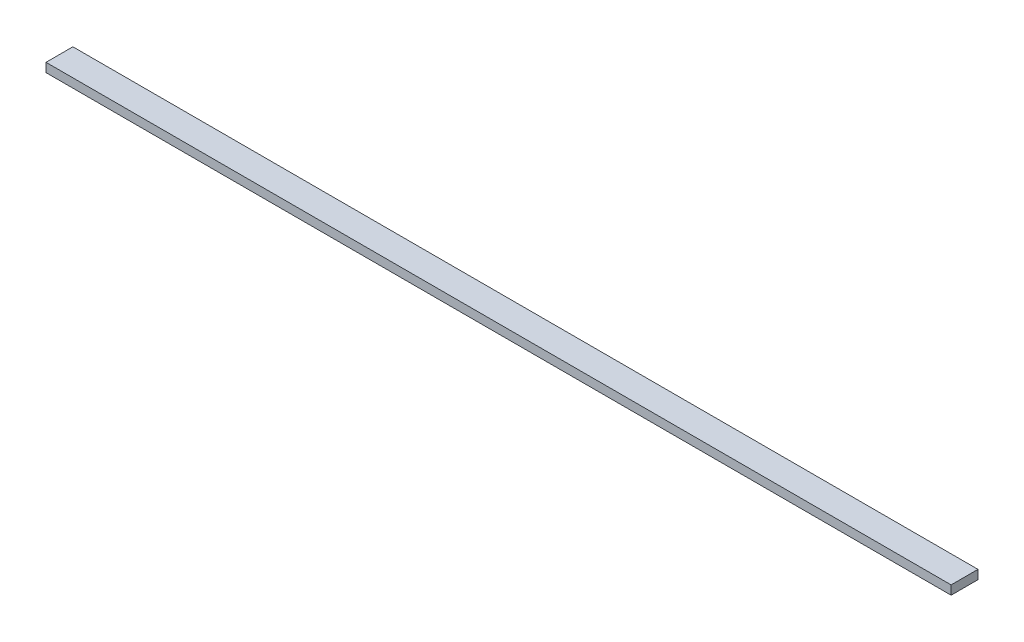
ISO-10303-21;
HEADER;
FILE_DESCRIPTION(('STEP AP214'),'2;1');
FILE_NAME('part.step','',(''),(''),'','','');
FILE_SCHEMA(('AUTOMOTIVE_DESIGN { 1 0 10303 214 1 1 1 1 }'));
ENDSEC;
DATA;
#1=APPLICATION_CONTEXT('core data for automotive mechanical design processes');
#2=APPLICATION_PROTOCOL_DEFINITION('international standard','automotive_design',2000,#1);
#3=PRODUCT_CONTEXT('',#1,'mechanical');
#4=PRODUCT('Part','Part','',(#3));
#5=PRODUCT_RELATED_PRODUCT_CATEGORY('part','',(#4));
#6=PRODUCT_DEFINITION_FORMATION('','',#4);
#7=PRODUCT_DEFINITION_CONTEXT('part definition',#1,'design');
#8=PRODUCT_DEFINITION('design','',#6,#7);
#9=PRODUCT_DEFINITION_SHAPE('','',#8);
#10=(LENGTH_UNIT() NAMED_UNIT(*) SI_UNIT(.MILLI.,.METRE.));
#11=(NAMED_UNIT(*) PLANE_ANGLE_UNIT() SI_UNIT($,.RADIAN.));
#12=(NAMED_UNIT(*) SI_UNIT($,.STERADIAN.) SOLID_ANGLE_UNIT());
#13=UNCERTAINTY_MEASURE_WITH_UNIT(LENGTH_MEASURE(1.E-05),#10,'distance_accuracy_value','');
#14=(GEOMETRIC_REPRESENTATION_CONTEXT(3) GLOBAL_UNCERTAINTY_ASSIGNED_CONTEXT((#13)) GLOBAL_UNIT_ASSIGNED_CONTEXT((#10,
#11,#12)) REPRESENTATION_CONTEXT('',''));
#15=CARTESIAN_POINT('',(0.,0.,0.));
#16=DIRECTION('',(0.,0.,1.));
#17=DIRECTION('',(1.,0.,0.));
#18=AXIS2_PLACEMENT_3D('',#15,#16,#17);
#19=CARTESIAN_POINT('',(-505.,10.,-14.9999999999999));
#20=DIRECTION('',(1.,0.,0.));
#21=DIRECTION('',(0.,0.,-1.));
#22=AXIS2_PLACEMENT_3D('',#19,#20,#21);
#23=PLANE('',#22);
#24=DIRECTION('',(0.,0.,1.));
#25=VECTOR('',#24,1.);
#26=CARTESIAN_POINT('',(-505.,0.,-14.9999999999999));
#27=LINE('',#26,#25);
#28=CARTESIAN_POINT('',(-505.,0.,-14.9999999999999));
#29=VERTEX_POINT('',#28);
#30=CARTESIAN_POINT('',(-505.,0.,15.0000000000001));
#31=VERTEX_POINT('',#30);
#32=EDGE_CURVE('E98',#29,#31,#27,.T.);
#33=ORIENTED_EDGE('',*,*,#32,.T.);
#34=DIRECTION('',(0.,-1.,0.));
#35=VECTOR('',#34,1.);
#36=CARTESIAN_POINT('',(-505.,10.,15.0000000000001));
#37=LINE('',#36,#35);
#38=CARTESIAN_POINT('',(-505.,10.,15.0000000000001));
#39=VERTEX_POINT('',#38);
#40=EDGE_CURVE('E11',#39,#31,#37,.T.);
#41=ORIENTED_EDGE('',*,*,#40,.F.);
#42=DIRECTION('',(0.,0.,1.));
#43=VECTOR('',#42,1.);
#44=CARTESIAN_POINT('',(-505.,10.,-14.9999999999999));
#45=LINE('',#44,#43);
#46=CARTESIAN_POINT('',(-505.,10.,-14.9999999999999));
#47=VERTEX_POINT('',#46);
#48=EDGE_CURVE('E86',#47,#39,#45,.T.);
#49=ORIENTED_EDGE('',*,*,#48,.F.);
#50=DIRECTION('',(0.,-1.,0.));
#51=VECTOR('',#50,1.);
#52=CARTESIAN_POINT('',(-505.,10.,-14.9999999999999));
#53=LINE('',#52,#51);
#54=EDGE_CURVE('E94',#47,#29,#53,.T.);
#55=ORIENTED_EDGE('',*,*,#54,.T.);
#56=EDGE_LOOP('',(#33,#41,#49,#55));
#57=FACE_BOUND('',#56,.T.);
#58=ADVANCED_FACE('F35',(#57),#23,.F.);
#59=CARTESIAN_POINT('',(-505.,10.,15.0000000000001));
#60=DIRECTION('',(0.,0.,-1.));
#61=DIRECTION('',(-1.,0.,0.));
#62=AXIS2_PLACEMENT_3D('',#59,#60,#61);
#63=PLANE('',#62);
#64=DIRECTION('',(1.,0.,0.));
#65=VECTOR('',#64,1.);
#66=CARTESIAN_POINT('',(-505.,0.,15.0000000000001));
#67=LINE('',#66,#65);
#68=CARTESIAN_POINT('',(505.,0.,15.));
#69=VERTEX_POINT('',#68);
#70=EDGE_CURVE('E90',#31,#69,#67,.T.);
#71=ORIENTED_EDGE('',*,*,#70,.T.);
#72=DIRECTION('',(0.,-1.,0.));
#73=VECTOR('',#72,1.);
#74=CARTESIAN_POINT('',(505.,10.,15.));
#75=LINE('',#74,#73);
#76=CARTESIAN_POINT('',(505.,10.,15.));
#77=VERTEX_POINT('',#76);
#78=EDGE_CURVE('E43',#77,#69,#75,.T.);
#79=ORIENTED_EDGE('',*,*,#78,.F.);
#80=DIRECTION('',(1.,0.,0.));
#81=VECTOR('',#80,1.);
#82=CARTESIAN_POINT('',(-505.,10.,15.0000000000001));
#83=LINE('',#82,#81);
#84=EDGE_CURVE('E81',#39,#77,#83,.T.);
#85=ORIENTED_EDGE('',*,*,#84,.F.);
#86=ORIENTED_EDGE('',*,*,#40,.T.);
#87=EDGE_LOOP('',(#71,#79,#85,#86));
#88=FACE_BOUND('',#87,.T.);
#89=ADVANCED_FACE('F89',(#88),#63,.F.);
#90=CARTESIAN_POINT('',(505.,10.,-14.9999999999999));
#91=DIRECTION('',(-1.,0.,0.));
#92=DIRECTION('',(0.,0.,1.));
#93=AXIS2_PLACEMENT_3D('',#90,#91,#92);
#94=PLANE('',#93);
#95=DIRECTION('',(0.,0.,-1.));
#96=VECTOR('',#95,1.);
#97=CARTESIAN_POINT('',(505.,0.,-14.9999999999999));
#98=LINE('',#97,#96);
#99=CARTESIAN_POINT('',(505.,0.,-14.9999999999999));
#100=VERTEX_POINT('',#99);
#101=EDGE_CURVE('E68',#69,#100,#98,.T.);
#102=ORIENTED_EDGE('',*,*,#101,.T.);
#103=DIRECTION('',(0.,-1.,0.));
#104=VECTOR('',#103,1.);
#105=CARTESIAN_POINT('',(505.,10.,-14.9999999999999));
#106=LINE('',#105,#104);
#107=CARTESIAN_POINT('',(505.,10.,-14.9999999999999));
#108=VERTEX_POINT('',#107);
#109=EDGE_CURVE('E91',#108,#100,#106,.T.);
#110=ORIENTED_EDGE('',*,*,#109,.F.);
#111=DIRECTION('',(0.,0.,-1.));
#112=VECTOR('',#111,1.);
#113=CARTESIAN_POINT('',(505.,10.,-14.9999999999999));
#114=LINE('',#113,#112);
#115=EDGE_CURVE('E84',#77,#108,#114,.T.);
#116=ORIENTED_EDGE('',*,*,#115,.F.);
#117=ORIENTED_EDGE('',*,*,#78,.T.);
#118=EDGE_LOOP('',(#102,#110,#116,#117));
#119=FACE_BOUND('',#118,.T.);
#120=ADVANCED_FACE('F92',(#119),#94,.F.);
#121=CARTESIAN_POINT('',(-505.,10.,-14.9999999999999));
#122=DIRECTION('',(0.,0.,1.));
#123=DIRECTION('',(1.,0.,0.));
#124=AXIS2_PLACEMENT_3D('',#121,#122,#123);
#125=PLANE('',#124);
#126=DIRECTION('',(-1.,0.,0.));
#127=VECTOR('',#126,1.);
#128=CARTESIAN_POINT('',(-505.,0.,-14.9999999999999));
#129=LINE('',#128,#127);
#130=EDGE_CURVE('E74',#100,#29,#129,.T.);
#131=ORIENTED_EDGE('',*,*,#130,.T.);
#132=ORIENTED_EDGE('',*,*,#54,.F.);
#133=DIRECTION('',(-1.,0.,0.));
#134=VECTOR('',#133,1.);
#135=CARTESIAN_POINT('',(-505.,10.,-14.9999999999999));
#136=LINE('',#135,#134);
#137=EDGE_CURVE('E51',#108,#47,#136,.T.);
#138=ORIENTED_EDGE('',*,*,#137,.F.);
#139=ORIENTED_EDGE('',*,*,#109,.T.);
#140=EDGE_LOOP('',(#131,#132,#138,#139));
#141=FACE_BOUND('',#140,.T.);
#142=ADVANCED_FACE('F105',(#141),#125,.F.);
#143=CARTESIAN_POINT('',(0.,10.,0.));
#144=DIRECTION('',(0.,1.,0.));
#145=DIRECTION('',(0.,0.,1.));
#146=AXIS2_PLACEMENT_3D('',#143,#144,#145);
#147=PLANE('',#146);
#148=ORIENTED_EDGE('',*,*,#48,.T.);
#149=ORIENTED_EDGE('',*,*,#84,.T.);
#150=ORIENTED_EDGE('',*,*,#115,.T.);
#151=ORIENTED_EDGE('',*,*,#137,.T.);
#152=EDGE_LOOP('',(#148,#149,#150,#151));
#153=FACE_BOUND('',#152,.T.);
#154=ADVANCED_FACE('F82',(#153),#147,.T.);
#155=CARTESIAN_POINT('',(0.,0.,0.));
#156=DIRECTION('',(0.,1.,0.));
#157=DIRECTION('',(0.,0.,1.));
#158=AXIS2_PLACEMENT_3D('',#155,#156,#157);
#159=PLANE('',#158);
#160=ORIENTED_EDGE('',*,*,#32,.F.);
#161=ORIENTED_EDGE('',*,*,#130,.F.);
#162=ORIENTED_EDGE('',*,*,#101,.F.);
#163=ORIENTED_EDGE('',*,*,#70,.F.);
#164=EDGE_LOOP('',(#160,#161,#162,#163));
#165=FACE_BOUND('',#164,.T.);
#166=ADVANCED_FACE('F108',(#165),#159,.F.);
#167=CLOSED_SHELL('',(#58,#89,#120,#142,#154,#166));
#168=MANIFOLD_SOLID_BREP('B2',#167);
#169=ADVANCED_BREP_SHAPE_REPRESENTATION('',(#18,#168),#14);
#170=SHAPE_DEFINITION_REPRESENTATION(#9,#169);
ENDSEC;
END-ISO-10303-21;
